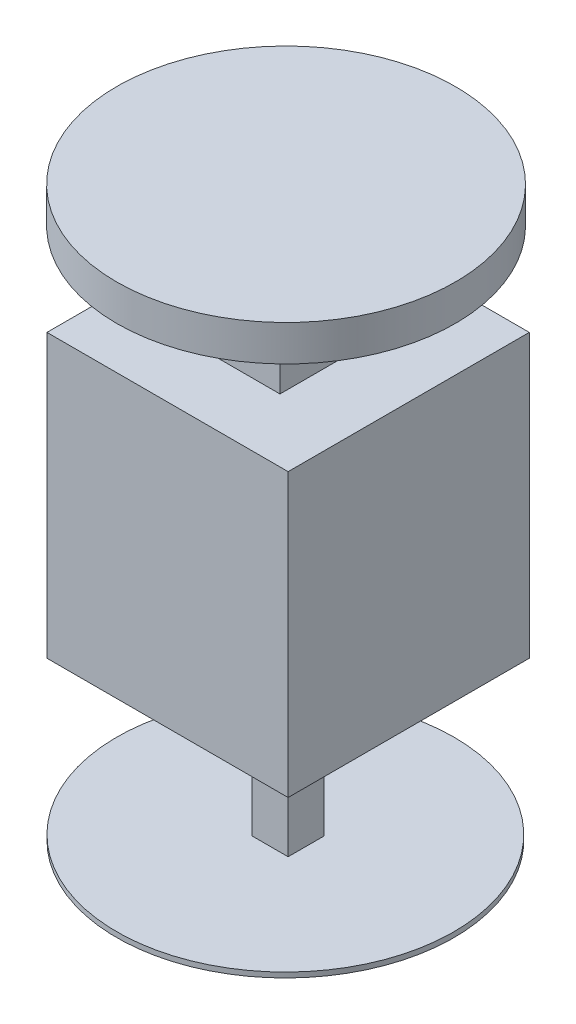
ISO-10303-21;
HEADER;
FILE_DESCRIPTION(('STEP AP214'),'2;1');
FILE_NAME('part.step','',(''),(''),'','','');
FILE_SCHEMA(('AUTOMOTIVE_DESIGN { 1 0 10303 214 1 1 1 1 }'));
ENDSEC;
DATA;
#1=APPLICATION_CONTEXT('core data for automotive mechanical design processes');
#2=APPLICATION_PROTOCOL_DEFINITION('international standard','automotive_design',2000,#1);
#3=PRODUCT_CONTEXT('',#1,'mechanical');
#4=PRODUCT('Part','Part','',(#3));
#5=PRODUCT_RELATED_PRODUCT_CATEGORY('part','',(#4));
#6=PRODUCT_DEFINITION_FORMATION('','',#4);
#7=PRODUCT_DEFINITION_CONTEXT('part definition',#1,'design');
#8=PRODUCT_DEFINITION('design','',#6,#7);
#9=PRODUCT_DEFINITION_SHAPE('','',#8);
#10=(LENGTH_UNIT() NAMED_UNIT(*) SI_UNIT(.MILLI.,.METRE.));
#11=(NAMED_UNIT(*) PLANE_ANGLE_UNIT() SI_UNIT($,.RADIAN.));
#12=(NAMED_UNIT(*) SI_UNIT($,.STERADIAN.) SOLID_ANGLE_UNIT());
#13=UNCERTAINTY_MEASURE_WITH_UNIT(LENGTH_MEASURE(1.E-05),#10,'distance_accuracy_value','');
#14=(GEOMETRIC_REPRESENTATION_CONTEXT(3) GLOBAL_UNCERTAINTY_ASSIGNED_CONTEXT((#13)) GLOBAL_UNIT_ASSIGNED_CONTEXT((#10,
#11,#12)) REPRESENTATION_CONTEXT('',''));
#15=CARTESIAN_POINT('',(0.,0.,0.));
#16=DIRECTION('',(0.,0.,1.));
#17=DIRECTION('',(1.,0.,0.));
#18=AXIS2_PLACEMENT_3D('',#15,#16,#17);
#19=CARTESIAN_POINT('',(0.,85.,0.));
#20=DIRECTION('',(0.,-1.,0.));
#21=DIRECTION('',(0.,0.,-1.));
#22=AXIS2_PLACEMENT_3D('',#19,#20,#21);
#23=PLANE('',#22);
#24=DIRECTION('',(0.,0.,1.));
#25=VECTOR('',#24,1.);
#26=CARTESIAN_POINT('',(0.,85.,0.));
#27=LINE('',#26,#25);
#28=CARTESIAN_POINT('',(0.,85.,-47.));
#29=VERTEX_POINT('',#28);
#30=CARTESIAN_POINT('',(0.,85.,0.));
#31=VERTEX_POINT('',#30);
#32=EDGE_CURVE('E175',#29,#31,#27,.T.);
#33=ORIENTED_EDGE('',*,*,#32,.T.);
#34=DIRECTION('',(1.,0.,0.));
#35=VECTOR('',#34,1.);
#36=CARTESIAN_POINT('',(0.,85.,0.));
#37=LINE('',#36,#35);
#38=CARTESIAN_POINT('',(47.,85.,0.));
#39=VERTEX_POINT('',#38);
#40=EDGE_CURVE('E179',#31,#39,#37,.T.);
#41=ORIENTED_EDGE('',*,*,#40,.T.);
#42=DIRECTION('',(0.,0.,-1.));
#43=VECTOR('',#42,1.);
#44=CARTESIAN_POINT('',(47.,85.,0.));
#45=LINE('',#44,#43);
#46=CARTESIAN_POINT('',(47.,85.,-47.));
#47=VERTEX_POINT('',#46);
#48=EDGE_CURVE('E181',#39,#47,#45,.T.);
#49=ORIENTED_EDGE('',*,*,#48,.T.);
#50=DIRECTION('',(-1.,0.,0.));
#51=VECTOR('',#50,1.);
#52=CARTESIAN_POINT('',(0.,85.,-47.));
#53=LINE('',#52,#51);
#54=EDGE_CURVE('E183',#47,#29,#53,.T.);
#55=ORIENTED_EDGE('',*,*,#54,.T.);
#56=EDGE_LOOP('',(#33,#41,#49,#55));
#57=FACE_BOUND('',#56,.T.);
#58=DIRECTION('',(0.,0.,1.));
#59=VECTOR('',#58,1.);
#60=CARTESIAN_POINT('',(15.2221150084543,85.,-31.2339096921015));
#61=LINE('',#60,#59);
#62=CARTESIAN_POINT('',(15.2221150084543,85.,-31.2339096921015));
#63=VERTEX_POINT('',#62);
#64=CARTESIAN_POINT('',(15.2221150084543,85.,-12.3130297114257));
#65=VERTEX_POINT('',#64);
#66=EDGE_CURVE('E256',#63,#65,#61,.T.);
#67=ORIENTED_EDGE('',*,*,#66,.F.);
#68=DIRECTION('',(-1.,0.,0.));
#69=VECTOR('',#68,1.);
#70=CARTESIAN_POINT('',(15.2221150084543,85.,-31.2339096921015));
#71=LINE('',#70,#69);
#72=CARTESIAN_POINT('',(33.102346590193,85.,-31.2339096921015));
#73=VERTEX_POINT('',#72);
#74=EDGE_CURVE('E250',#73,#63,#71,.T.);
#75=ORIENTED_EDGE('',*,*,#74,.F.);
#76=DIRECTION('',(0.,0.,-1.));
#77=VECTOR('',#76,1.);
#78=CARTESIAN_POINT('',(33.102346590193,85.,-31.2339096921015));
#79=LINE('',#78,#77);
#80=CARTESIAN_POINT('',(33.102346590193,85.,-12.3130297114257));
#81=VERTEX_POINT('',#80);
#82=EDGE_CURVE('E53',#81,#73,#79,.T.);
#83=ORIENTED_EDGE('',*,*,#82,.F.);
#84=DIRECTION('',(1.,0.,0.));
#85=VECTOR('',#84,1.);
#86=CARTESIAN_POINT('',(15.2221150084543,85.,-12.3130297114257));
#87=LINE('',#86,#85);
#88=EDGE_CURVE('E48',#65,#81,#87,.T.);
#89=ORIENTED_EDGE('',*,*,#88,.F.);
#90=EDGE_LOOP('',(#67,#75,#83,#89));
#91=FACE_BOUND('',#90,.T.);
#92=ADVANCED_FACE('F33',(#57,#91),#23,.F.);
#93=CARTESIAN_POINT('',(20.,0.,0.));
#94=DIRECTION('',(-1.,0.,0.));
#95=DIRECTION('',(0.,0.,1.));
#96=AXIS2_PLACEMENT_3D('',#93,#94,#95);
#97=PLANE('',#96);
#98=DIRECTION('',(0.,0.,-1.));
#99=VECTOR('',#98,1.);
#100=CARTESIAN_POINT('',(20.,29.9491585528498,-20.));
#101=LINE('',#100,#99);
#102=CARTESIAN_POINT('',(20.,29.9491585528498,-20.));
#103=VERTEX_POINT('',#102);
#104=CARTESIAN_POINT('',(20.,29.9491585528498,-27.));
#105=VERTEX_POINT('',#104);
#106=EDGE_CURVE('E218',#103,#105,#101,.T.);
#107=ORIENTED_EDGE('',*,*,#106,.T.);
#108=DIRECTION('',(0.,1.,0.));
#109=VECTOR('',#108,1.);
#110=CARTESIAN_POINT('',(20.,0.,-27.));
#111=LINE('',#110,#109);
#112=CARTESIAN_POINT('',(20.,0.,-27.));
#113=VERTEX_POINT('',#112);
#114=EDGE_CURVE('E234',#113,#105,#111,.T.);
#115=ORIENTED_EDGE('',*,*,#114,.F.);
#116=DIRECTION('',(0.,0.,1.));
#117=VECTOR('',#116,1.);
#118=CARTESIAN_POINT('',(20.,0.,-20.));
#119=LINE('',#118,#117);
#120=CARTESIAN_POINT('',(20.,0.,-20.));
#121=VERTEX_POINT('',#120);
#122=EDGE_CURVE('E212',#113,#121,#119,.T.);
#123=ORIENTED_EDGE('',*,*,#122,.T.);
#124=DIRECTION('',(0.,1.,0.));
#125=VECTOR('',#124,1.);
#126=CARTESIAN_POINT('',(20.,0.,-20.));
#127=LINE('',#126,#125);
#128=EDGE_CURVE('E160',#121,#103,#127,.T.);
#129=ORIENTED_EDGE('',*,*,#128,.T.);
#130=EDGE_LOOP('',(#107,#115,#123,#129));
#131=FACE_BOUND('',#130,.T.);
#132=ADVANCED_FACE('F297',(#131),#97,.T.);
#133=CARTESIAN_POINT('',(0.,85.,0.));
#134=DIRECTION('',(1.,0.,0.));
#135=DIRECTION('',(0.,0.,-1.));
#136=AXIS2_PLACEMENT_3D('',#133,#134,#135);
#137=PLANE('',#136);
#138=DIRECTION('',(0.,-1.,0.));
#139=VECTOR('',#138,1.);
#140=CARTESIAN_POINT('',(0.,85.,-47.));
#141=LINE('',#140,#139);
#142=CARTESIAN_POINT('',(0.,29.9491585528498,-47.));
#143=VERTEX_POINT('',#142);
#144=EDGE_CURVE('E185',#29,#143,#141,.T.);
#145=ORIENTED_EDGE('',*,*,#144,.T.);
#146=DIRECTION('',(0.,0.,-1.));
#147=VECTOR('',#146,1.);
#148=CARTESIAN_POINT('',(0.,29.9491585528498,-20.));
#149=LINE('',#148,#147);
#150=CARTESIAN_POINT('',(0.,29.9491585528498,-20.));
#151=VERTEX_POINT('',#150);
#152=EDGE_CURVE('E208',#151,#143,#149,.T.);
#153=ORIENTED_EDGE('',*,*,#152,.F.);
#154=DIRECTION('',(0.,-1.,0.));
#155=VECTOR('',#154,1.);
#156=CARTESIAN_POINT('',(0.,0.,-20.));
#157=LINE('',#156,#155);
#158=CARTESIAN_POINT('',(0.,30.,-20.));
#159=VERTEX_POINT('',#158);
#160=EDGE_CURVE('E162',#159,#151,#157,.T.);
#161=ORIENTED_EDGE('',*,*,#160,.F.);
#162=DIRECTION('',(0.,0.,1.));
#163=VECTOR('',#162,1.);
#164=CARTESIAN_POINT('',(0.,30.,-20.));
#165=LINE('',#164,#163);
#166=CARTESIAN_POINT('',(0.,30.,0.));
#167=VERTEX_POINT('',#166);
#168=EDGE_CURVE('E164',#159,#167,#165,.T.);
#169=ORIENTED_EDGE('',*,*,#168,.T.);
#170=DIRECTION('',(0.,-1.,0.));
#171=VECTOR('',#170,1.);
#172=CARTESIAN_POINT('',(0.,85.,0.));
#173=LINE('',#172,#171);
#174=EDGE_CURVE('E11',#31,#167,#173,.T.);
#175=ORIENTED_EDGE('',*,*,#174,.F.);
#176=ORIENTED_EDGE('',*,*,#32,.F.);
#177=EDGE_LOOP('',(#145,#153,#161,#169,#175,#176));
#178=FACE_BOUND('',#177,.T.);
#179=ADVANCED_FACE('F35',(#178),#137,.F.);
#180=CARTESIAN_POINT('',(0.,85.,0.));
#181=DIRECTION('',(0.,0.,-1.));
#182=DIRECTION('',(-1.,0.,0.));
#183=AXIS2_PLACEMENT_3D('',#180,#181,#182);
#184=PLANE('',#183);
#185=ORIENTED_EDGE('',*,*,#174,.T.);
#186=DIRECTION('',(-1.,0.,0.));
#187=VECTOR('',#186,1.);
#188=CARTESIAN_POINT('',(47.,30.,0.));
#189=LINE('',#188,#187);
#190=CARTESIAN_POINT('',(47.,30.,0.));
#191=VERTEX_POINT('',#190);
#192=EDGE_CURVE('E171',#191,#167,#189,.T.);
#193=ORIENTED_EDGE('',*,*,#192,.F.);
#194=DIRECTION('',(0.,-1.,0.));
#195=VECTOR('',#194,1.);
#196=CARTESIAN_POINT('',(47.,85.,0.));
#197=LINE('',#196,#195);
#198=EDGE_CURVE('E41',#39,#191,#197,.T.);
#199=ORIENTED_EDGE('',*,*,#198,.F.);
#200=ORIENTED_EDGE('',*,*,#40,.F.);
#201=EDGE_LOOP('',(#185,#193,#199,#200));
#202=FACE_BOUND('',#201,.T.);
#203=ADVANCED_FACE('F199',(#202),#184,.F.);
#204=CARTESIAN_POINT('',(47.,85.,0.));
#205=DIRECTION('',(-1.,0.,0.));
#206=DIRECTION('',(0.,0.,1.));
#207=AXIS2_PLACEMENT_3D('',#204,#205,#206);
#208=PLANE('',#207);
#209=DIRECTION('',(0.,0.,1.));
#210=VECTOR('',#209,1.);
#211=CARTESIAN_POINT('',(47.,30.,-20.));
#212=LINE('',#211,#210);
#213=CARTESIAN_POINT('',(47.,30.,-47.));
#214=VERTEX_POINT('',#213);
#215=EDGE_CURVE('E161',#214,#191,#212,.T.);
#216=ORIENTED_EDGE('',*,*,#215,.F.);
#217=DIRECTION('',(0.,-1.,0.));
#218=VECTOR('',#217,1.);
#219=CARTESIAN_POINT('',(47.,85.,-47.));
#220=LINE('',#219,#218);
#221=EDGE_CURVE('E188',#47,#214,#220,.T.);
#222=ORIENTED_EDGE('',*,*,#221,.F.);
#223=ORIENTED_EDGE('',*,*,#48,.F.);
#224=ORIENTED_EDGE('',*,*,#198,.T.);
#225=EDGE_LOOP('',(#216,#222,#223,#224));
#226=FACE_BOUND('',#225,.T.);
#227=ADVANCED_FACE('F194',(#226),#208,.F.);
#228=CARTESIAN_POINT('',(0.,85.,-47.));
#229=DIRECTION('',(0.,0.,1.));
#230=DIRECTION('',(1.,0.,0.));
#231=AXIS2_PLACEMENT_3D('',#228,#229,#230);
#232=PLANE('',#231);
#233=DIRECTION('',(1.,0.,0.));
#234=VECTOR('',#233,1.);
#235=CARTESIAN_POINT('',(20.,30.,-47.));
#236=LINE('',#235,#234);
#237=CARTESIAN_POINT('',(20.,30.,-47.));
#238=VERTEX_POINT('',#237);
#239=EDGE_CURVE('E225',#238,#214,#236,.T.);
#240=ORIENTED_EDGE('',*,*,#239,.F.);
#241=DIRECTION('',(0.,1.,0.));
#242=VECTOR('',#241,1.);
#243=CARTESIAN_POINT('',(20.,0.,-47.));
#244=LINE('',#243,#242);
#245=CARTESIAN_POINT('',(20.,29.9491585528498,-47.));
#246=VERTEX_POINT('',#245);
#247=EDGE_CURVE('E228',#246,#238,#244,.T.);
#248=ORIENTED_EDGE('',*,*,#247,.F.);
#249=DIRECTION('',(-1.,0.,0.));
#250=VECTOR('',#249,1.);
#251=CARTESIAN_POINT('',(20.,29.9491585528498,-47.));
#252=LINE('',#251,#250);
#253=EDGE_CURVE('E173',#246,#143,#252,.T.);
#254=ORIENTED_EDGE('',*,*,#253,.T.);
#255=ORIENTED_EDGE('',*,*,#144,.F.);
#256=ORIENTED_EDGE('',*,*,#54,.F.);
#257=ORIENTED_EDGE('',*,*,#221,.T.);
#258=EDGE_LOOP('',(#240,#248,#254,#255,#256,#257));
#259=FACE_BOUND('',#258,.T.);
#260=ADVANCED_FACE('F309',(#259),#232,.F.);
#261=CARTESIAN_POINT('',(47.,30.,-20.));
#262=DIRECTION('',(0.,1.,0.));
#263=DIRECTION('',(0.,0.,1.));
#264=AXIS2_PLACEMENT_3D('',#261,#262,#263);
#265=PLANE('',#264);
#266=ORIENTED_EDGE('',*,*,#192,.T.);
#267=ORIENTED_EDGE('',*,*,#168,.F.);
#268=DIRECTION('',(-1.,0.,0.));
#269=VECTOR('',#268,1.);
#270=CARTESIAN_POINT('',(47.,30.,-20.));
#271=LINE('',#270,#269);
#272=CARTESIAN_POINT('',(27.,30.,-20.));
#273=VERTEX_POINT('',#272);
#274=EDGE_CURVE('E167',#273,#159,#271,.T.);
#275=ORIENTED_EDGE('',*,*,#274,.F.);
#276=DIRECTION('',(0.,0.,1.));
#277=VECTOR('',#276,1.);
#278=CARTESIAN_POINT('',(27.,30.,-20.));
#279=LINE('',#278,#277);
#280=CARTESIAN_POINT('',(27.,30.,-27.));
#281=VERTEX_POINT('',#280);
#282=EDGE_CURVE('E151',#281,#273,#279,.T.);
#283=ORIENTED_EDGE('',*,*,#282,.F.);
#284=DIRECTION('',(1.,0.,0.));
#285=VECTOR('',#284,1.);
#286=CARTESIAN_POINT('',(20.,30.,-27.));
#287=LINE('',#286,#285);
#288=CARTESIAN_POINT('',(20.,30.,-27.));
#289=VERTEX_POINT('',#288);
#290=EDGE_CURVE('E231',#289,#281,#287,.T.);
#291=ORIENTED_EDGE('',*,*,#290,.F.);
#292=DIRECTION('',(0.,0.,-1.));
#293=VECTOR('',#292,1.);
#294=CARTESIAN_POINT('',(20.,30.,-27.));
#295=LINE('',#294,#293);
#296=EDGE_CURVE('E216',#289,#238,#295,.T.);
#297=ORIENTED_EDGE('',*,*,#296,.T.);
#298=ORIENTED_EDGE('',*,*,#239,.T.);
#299=ORIENTED_EDGE('',*,*,#215,.T.);
#300=EDGE_LOOP('',(#266,#267,#275,#283,#291,#297,#298,#299));
#301=FACE_BOUND('',#300,.T.);
#302=ADVANCED_FACE('F203',(#301),#265,.F.);
#303=CARTESIAN_POINT('',(0.,0.,-20.));
#304=DIRECTION('',(0.,0.,1.));
#305=DIRECTION('',(1.,0.,0.));
#306=AXIS2_PLACEMENT_3D('',#303,#304,#305);
#307=PLANE('',#306);
#308=DIRECTION('',(0.,-1.,0.));
#309=VECTOR('',#308,1.);
#310=CARTESIAN_POINT('',(27.,0.,-20.));
#311=LINE('',#310,#309);
#312=CARTESIAN_POINT('',(27.,0.,-20.));
#313=VERTEX_POINT('',#312);
#314=EDGE_CURVE('E146',#273,#313,#311,.T.);
#315=ORIENTED_EDGE('',*,*,#314,.F.);
#316=ORIENTED_EDGE('',*,*,#274,.T.);
#317=ORIENTED_EDGE('',*,*,#160,.T.);
#318=DIRECTION('',(-1.,0.,0.));
#319=VECTOR('',#318,1.);
#320=CARTESIAN_POINT('',(20.,29.9491585528498,-20.));
#321=LINE('',#320,#319);
#322=EDGE_CURVE('E209',#103,#151,#321,.T.);
#323=ORIENTED_EDGE('',*,*,#322,.F.);
#324=ORIENTED_EDGE('',*,*,#128,.F.);
#325=DIRECTION('',(1.,0.,0.));
#326=VECTOR('',#325,1.);
#327=CARTESIAN_POINT('',(47.,0.,-20.));
#328=LINE('',#327,#326);
#329=EDGE_CURVE('E139',#121,#313,#328,.T.);
#330=ORIENTED_EDGE('',*,*,#329,.T.);
#331=EDGE_LOOP('',(#315,#316,#317,#323,#324,#330));
#332=FACE_BOUND('',#331,.T.);
#333=ADVANCED_FACE('F157',(#332),#307,.T.);
#334=CARTESIAN_POINT('',(20.,29.9491585528498,-20.));
#335=DIRECTION('',(0.,1.,0.));
#336=DIRECTION('',(0.,0.,1.));
#337=AXIS2_PLACEMENT_3D('',#334,#335,#336);
#338=PLANE('',#337);
#339=ORIENTED_EDGE('',*,*,#152,.T.);
#340=ORIENTED_EDGE('',*,*,#253,.F.);
#341=EDGE_CURVE('E221',#105,#246,#101,.T.);
#342=ORIENTED_EDGE('',*,*,#341,.F.);
#343=ORIENTED_EDGE('',*,*,#106,.F.);
#344=ORIENTED_EDGE('',*,*,#322,.T.);
#345=EDGE_LOOP('',(#339,#340,#342,#343,#344));
#346=FACE_BOUND('',#345,.T.);
#347=ADVANCED_FACE('F339',(#346),#338,.F.);
#348=CARTESIAN_POINT('',(20.,0.,-27.));
#349=DIRECTION('',(-1.,0.,0.));
#350=DIRECTION('',(0.,0.,1.));
#351=AXIS2_PLACEMENT_3D('',#348,#349,#350);
#352=PLANE('',#351);
#353=ORIENTED_EDGE('',*,*,#247,.T.);
#354=ORIENTED_EDGE('',*,*,#296,.F.);
#355=EDGE_CURVE('E227',#105,#289,#111,.T.);
#356=ORIENTED_EDGE('',*,*,#355,.F.);
#357=ORIENTED_EDGE('',*,*,#341,.T.);
#358=EDGE_LOOP('',(#353,#354,#356,#357));
#359=FACE_BOUND('',#358,.T.);
#360=ADVANCED_FACE('F348',(#359),#352,.F.);
#361=CARTESIAN_POINT('',(0.,0.,-27.));
#362=DIRECTION('',(0.,0.,-1.));
#363=DIRECTION('',(-1.,0.,0.));
#364=AXIS2_PLACEMENT_3D('',#361,#362,#363);
#365=PLANE('',#364);
#366=DIRECTION('',(0.,1.,0.));
#367=VECTOR('',#366,1.);
#368=CARTESIAN_POINT('',(27.,0.,-27.));
#369=LINE('',#368,#367);
#370=CARTESIAN_POINT('',(27.,0.,-27.));
#371=VERTEX_POINT('',#370);
#372=EDGE_CURVE('E145',#371,#281,#369,.T.);
#373=ORIENTED_EDGE('',*,*,#372,.F.);
#374=DIRECTION('',(-1.,0.,0.));
#375=VECTOR('',#374,1.);
#376=CARTESIAN_POINT('',(20.,0.,-27.));
#377=LINE('',#376,#375);
#378=EDGE_CURVE('E142',#371,#113,#377,.T.);
#379=ORIENTED_EDGE('',*,*,#378,.T.);
#380=ORIENTED_EDGE('',*,*,#114,.T.);
#381=ORIENTED_EDGE('',*,*,#355,.T.);
#382=ORIENTED_EDGE('',*,*,#290,.T.);
#383=EDGE_LOOP('',(#373,#379,#380,#381,#382));
#384=FACE_BOUND('',#383,.T.);
#385=ADVANCED_FACE('F344',(#384),#365,.T.);
#386=CARTESIAN_POINT('',(27.,0.,0.));
#387=DIRECTION('',(-1.,0.,0.));
#388=DIRECTION('',(0.,0.,1.));
#389=AXIS2_PLACEMENT_3D('',#386,#387,#388);
#390=PLANE('',#389);
#391=ORIENTED_EDGE('',*,*,#314,.T.);
#392=DIRECTION('',(0.,0.,-1.));
#393=VECTOR('',#392,1.);
#394=CARTESIAN_POINT('',(27.,0.,-20.));
#395=LINE('',#394,#393);
#396=EDGE_CURVE('E134',#313,#371,#395,.T.);
#397=ORIENTED_EDGE('',*,*,#396,.T.);
#398=ORIENTED_EDGE('',*,*,#372,.T.);
#399=ORIENTED_EDGE('',*,*,#282,.T.);
#400=EDGE_LOOP('',(#391,#397,#398,#399));
#401=FACE_BOUND('',#400,.T.);
#402=ADVANCED_FACE('F149',(#401),#390,.F.);
#403=CARTESIAN_POINT('',(15.2221150084543,103.,-31.2339096921015));
#404=DIRECTION('',(1.,0.,0.));
#405=DIRECTION('',(0.,0.,-1.));
#406=AXIS2_PLACEMENT_3D('',#403,#404,#405);
#407=PLANE('',#406);
#408=ORIENTED_EDGE('',*,*,#66,.T.);
#409=DIRECTION('',(0.,-1.,0.));
#410=VECTOR('',#409,1.);
#411=CARTESIAN_POINT('',(15.2221150084543,103.,-12.3130297114257));
#412=LINE('',#411,#410);
#413=CARTESIAN_POINT('',(15.2221150084543,103.,-12.3130297114257));
#414=VERTEX_POINT('',#413);
#415=EDGE_CURVE('E154',#414,#65,#412,.T.);
#416=ORIENTED_EDGE('',*,*,#415,.F.);
#417=DIRECTION('',(0.,0.,1.));
#418=VECTOR('',#417,1.);
#419=CARTESIAN_POINT('',(15.2221150084543,103.,-31.2339096921015));
#420=LINE('',#419,#418);
#421=CARTESIAN_POINT('',(15.2221150084543,103.,-31.2339096921015));
#422=VERTEX_POINT('',#421);
#423=EDGE_CURVE('E253',#422,#414,#420,.T.);
#424=ORIENTED_EDGE('',*,*,#423,.F.);
#425=DIRECTION('',(0.,-1.,0.));
#426=VECTOR('',#425,1.);
#427=CARTESIAN_POINT('',(15.2221150084543,103.,-31.2339096921015));
#428=LINE('',#427,#426);
#429=EDGE_CURVE('E246',#422,#63,#428,.T.);
#430=ORIENTED_EDGE('',*,*,#429,.T.);
#431=EDGE_LOOP('',(#408,#416,#424,#430));
#432=FACE_BOUND('',#431,.T.);
#433=ADVANCED_FACE('F357',(#432),#407,.F.);
#434=CARTESIAN_POINT('',(15.2221150084543,103.,-12.3130297114257));
#435=DIRECTION('',(0.,0.,-1.));
#436=DIRECTION('',(-1.,0.,0.));
#437=AXIS2_PLACEMENT_3D('',#434,#435,#436);
#438=PLANE('',#437);
#439=ORIENTED_EDGE('',*,*,#88,.T.);
#440=DIRECTION('',(0.,-1.,0.));
#441=VECTOR('',#440,1.);
#442=CARTESIAN_POINT('',(33.102346590193,103.,-12.3130297114257));
#443=LINE('',#442,#441);
#444=CARTESIAN_POINT('',(33.102346590193,103.,-12.3130297114257));
#445=VERTEX_POINT('',#444);
#446=EDGE_CURVE('E240',#445,#81,#443,.T.);
#447=ORIENTED_EDGE('',*,*,#446,.F.);
#448=DIRECTION('',(1.,0.,0.));
#449=VECTOR('',#448,1.);
#450=CARTESIAN_POINT('',(15.2221150084543,103.,-12.3130297114257));
#451=LINE('',#450,#449);
#452=EDGE_CURVE('E265',#414,#445,#451,.T.);
#453=ORIENTED_EDGE('',*,*,#452,.F.);
#454=ORIENTED_EDGE('',*,*,#415,.T.);
#455=EDGE_LOOP('',(#439,#447,#453,#454));
#456=FACE_BOUND('',#455,.T.);
#457=ADVANCED_FACE('F408',(#456),#438,.F.);
#458=CARTESIAN_POINT('',(33.102346590193,103.,-31.2339096921015));
#459=DIRECTION('',(-1.,0.,0.));
#460=DIRECTION('',(0.,0.,1.));
#461=AXIS2_PLACEMENT_3D('',#458,#459,#460);
#462=PLANE('',#461);
#463=ORIENTED_EDGE('',*,*,#82,.T.);
#464=DIRECTION('',(0.,-1.,0.));
#465=VECTOR('',#464,1.);
#466=CARTESIAN_POINT('',(33.102346590193,103.,-31.2339096921015));
#467=LINE('',#466,#465);
#468=CARTESIAN_POINT('',(33.102346590193,103.,-31.2339096921015));
#469=VERTEX_POINT('',#468);
#470=EDGE_CURVE('E243',#469,#73,#467,.T.);
#471=ORIENTED_EDGE('',*,*,#470,.F.);
#472=DIRECTION('',(0.,0.,-1.));
#473=VECTOR('',#472,1.);
#474=CARTESIAN_POINT('',(33.102346590193,103.,-31.2339096921015));
#475=LINE('',#474,#473);
#476=EDGE_CURVE('E262',#445,#469,#475,.T.);
#477=ORIENTED_EDGE('',*,*,#476,.F.);
#478=ORIENTED_EDGE('',*,*,#446,.T.);
#479=EDGE_LOOP('',(#463,#471,#477,#478));
#480=FACE_BOUND('',#479,.T.);
#481=ADVANCED_FACE('F400',(#480),#462,.F.);
#482=CARTESIAN_POINT('',(15.2221150084543,103.,-31.2339096921015));
#483=DIRECTION('',(0.,0.,1.));
#484=DIRECTION('',(1.,0.,0.));
#485=AXIS2_PLACEMENT_3D('',#482,#483,#484);
#486=PLANE('',#485);
#487=ORIENTED_EDGE('',*,*,#74,.T.);
#488=ORIENTED_EDGE('',*,*,#429,.F.);
#489=DIRECTION('',(-1.,0.,0.));
#490=VECTOR('',#489,1.);
#491=CARTESIAN_POINT('',(15.2221150084543,103.,-31.2339096921015));
#492=LINE('',#491,#490);
#493=EDGE_CURVE('E249',#469,#422,#492,.T.);
#494=ORIENTED_EDGE('',*,*,#493,.F.);
#495=ORIENTED_EDGE('',*,*,#470,.T.);
#496=EDGE_LOOP('',(#487,#488,#494,#495));
#497=FACE_BOUND('',#496,.T.);
#498=ADVANCED_FACE('F392',(#497),#486,.F.);
#499=CARTESIAN_POINT('',(23.2989656502055,103.,-23.2989656502055));
#500=DIRECTION('',(0.,1.,0.));
#501=DIRECTION('',(0.,0.,1.));
#502=AXIS2_PLACEMENT_3D('',#499,#500,#501);
#503=PLANE('',#502);
#504=CARTESIAN_POINT('',(23.2989656502055,103.,-23.2989656502055));
#505=DIRECTION('',(0.,1.,0.));
#506=DIRECTION('',(0.,0.,1.));
#507=AXIS2_PLACEMENT_3D('',#504,#505,#506);
#508=CIRCLE('',#507,33.);
#509=CARTESIAN_POINT('',(23.2989656502055,103.,9.7010343497945));
#510=VERTEX_POINT('',#509);
#511=EDGE_CURVE('E270',#510,#510,#508,.T.);
#512=ORIENTED_EDGE('',*,*,#511,.F.);
#513=EDGE_LOOP('',(#512));
#514=FACE_BOUND('',#513,.T.);
#515=ORIENTED_EDGE('',*,*,#493,.T.);
#516=ORIENTED_EDGE('',*,*,#423,.T.);
#517=ORIENTED_EDGE('',*,*,#452,.T.);
#518=ORIENTED_EDGE('',*,*,#476,.T.);
#519=EDGE_LOOP('',(#515,#516,#517,#518));
#520=FACE_BOUND('',#519,.T.);
#521=ADVANCED_FACE('F384',(#514,#520),#503,.F.);
#522=CARTESIAN_POINT('',(23.2989656502055,110.,-23.2989656502055));
#523=DIRECTION('',(0.,-1.,0.));
#524=DIRECTION('',(0.,0.,-1.));
#525=AXIS2_PLACEMENT_3D('',#522,#523,#524);
#526=CYLINDRICAL_SURFACE('',#525,33.);
#527=CARTESIAN_POINT('',(23.2989656502055,110.,-23.2989656502055));
#528=DIRECTION('',(0.,1.,0.));
#529=DIRECTION('',(0.,0.,1.));
#530=AXIS2_PLACEMENT_3D('',#527,#528,#529);
#531=CIRCLE('',#530,33.);
#532=CARTESIAN_POINT('',(23.2989656502055,110.,9.7010343497945));
#533=VERTEX_POINT('',#532);
#534=EDGE_CURVE('E259',#533,#533,#531,.T.);
#535=ORIENTED_EDGE('',*,*,#534,.F.);
#536=EDGE_LOOP('',(#535));
#537=FACE_BOUND('',#536,.T.);
#538=ORIENTED_EDGE('',*,*,#511,.T.);
#539=EDGE_LOOP('',(#538));
#540=FACE_BOUND('',#539,.T.);
#541=ADVANCED_FACE('F379',(#537,#540),#526,.T.);
#542=CARTESIAN_POINT('',(23.2989656502055,110.,-23.2989656502055));
#543=DIRECTION('',(0.,1.,0.));
#544=DIRECTION('',(0.,0.,1.));
#545=AXIS2_PLACEMENT_3D('',#542,#543,#544);
#546=PLANE('',#545);
#547=ORIENTED_EDGE('',*,*,#534,.T.);
#548=EDGE_LOOP('',(#547));
#549=FACE_BOUND('',#548,.T.);
#550=ADVANCED_FACE('F287',(#549),#546,.T.);
#551=CARTESIAN_POINT('',(22.9615027606462,-1.,-23.5));
#552=DIRECTION('',(0.,1.,0.));
#553=DIRECTION('',(0.,0.,1.));
#554=AXIS2_PLACEMENT_3D('',#551,#552,#553);
#555=CYLINDRICAL_SURFACE('',#554,32.8554502179952);
#556=CARTESIAN_POINT('',(22.9615027606462,-1.,-23.5));
#557=DIRECTION('',(0.,-1.,0.));
#558=DIRECTION('',(0.,0.,-1.));
#559=AXIS2_PLACEMENT_3D('',#556,#557,#558);
#560=CIRCLE('',#559,32.8554502179952);
#561=CARTESIAN_POINT('',(22.9615027606462,-1.,-56.3554502179952));
#562=VERTEX_POINT('',#561);
#563=EDGE_CURVE('E273',#562,#562,#560,.T.);
#564=ORIENTED_EDGE('',*,*,#563,.F.);
#565=EDGE_LOOP('',(#564));
#566=FACE_BOUND('',#565,.T.);
#567=CARTESIAN_POINT('',(22.9615027606462,0.,-23.5));
#568=DIRECTION('',(0.,-1.,0.));
#569=DIRECTION('',(0.,0.,-1.));
#570=AXIS2_PLACEMENT_3D('',#567,#568,#569);
#571=CIRCLE('',#570,32.8554502179952);
#572=CARTESIAN_POINT('',(22.9615027606462,0.,-56.3554502179952));
#573=VERTEX_POINT('',#572);
#574=EDGE_CURVE('E276',#573,#573,#571,.T.);
#575=ORIENTED_EDGE('',*,*,#574,.T.);
#576=EDGE_LOOP('',(#575));
#577=FACE_BOUND('',#576,.T.);
#578=ADVANCED_FACE('F284',(#566,#577),#555,.T.);
#579=CARTESIAN_POINT('',(22.9615027606462,-1.,-23.5));
#580=DIRECTION('',(0.,-1.,0.));
#581=DIRECTION('',(0.,0.,-1.));
#582=AXIS2_PLACEMENT_3D('',#579,#580,#581);
#583=PLANE('',#582);
#584=ORIENTED_EDGE('',*,*,#563,.T.);
#585=EDGE_LOOP('',(#584));
#586=FACE_BOUND('',#585,.T.);
#587=ADVANCED_FACE('F282',(#586),#583,.T.);
#588=CARTESIAN_POINT('',(22.9615027606462,0.,-23.5));
#589=DIRECTION('',(0.,-1.,0.));
#590=DIRECTION('',(0.,0.,-1.));
#591=AXIS2_PLACEMENT_3D('',#588,#589,#590);
#592=PLANE('',#591);
#593=ORIENTED_EDGE('',*,*,#122,.F.);
#594=ORIENTED_EDGE('',*,*,#378,.F.);
#595=ORIENTED_EDGE('',*,*,#396,.F.);
#596=ORIENTED_EDGE('',*,*,#329,.F.);
#597=EDGE_LOOP('',(#593,#594,#595,#596));
#598=FACE_BOUND('',#597,.T.);
#599=ORIENTED_EDGE('',*,*,#574,.F.);
#600=EDGE_LOOP('',(#599));
#601=FACE_BOUND('',#600,.T.);
#602=ADVANCED_FACE('F136',(#598,#601),#592,.F.);
#603=CLOSED_SHELL('',(#92,#132,#179,#203,#227,#260,#302,#333,#347,#360,#385,#402,#433,#457,#481,
#498,#521,#541,#550,#578,#587,#602));
#604=MANIFOLD_SOLID_BREP('B2',#603);
#605=ADVANCED_BREP_SHAPE_REPRESENTATION('',(#18,#604),#14);
#606=SHAPE_DEFINITION_REPRESENTATION(#9,#605);
ENDSEC;
END-ISO-10303-21;
